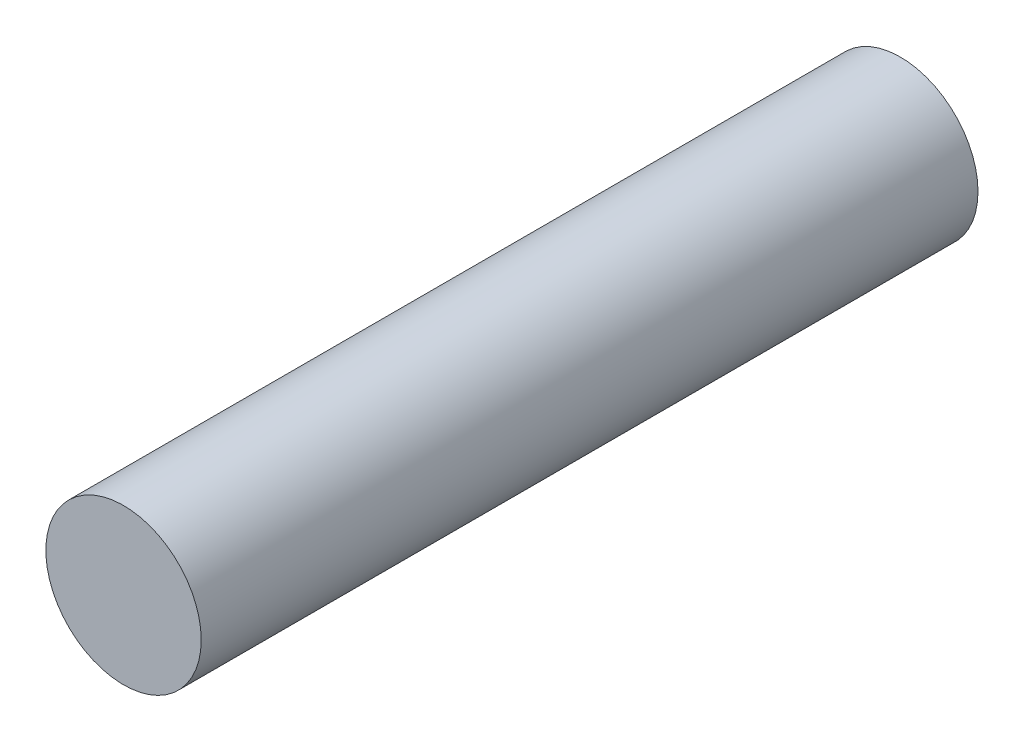
ISO-10303-21;
HEADER;
FILE_DESCRIPTION(('STEP AP214'),'2;1');
FILE_NAME('part.step','',(''),(''),'','','');
FILE_SCHEMA(('AUTOMOTIVE_DESIGN { 1 0 10303 214 1 1 1 1 }'));
ENDSEC;
DATA;
#1=APPLICATION_CONTEXT('core data for automotive mechanical design processes');
#2=APPLICATION_PROTOCOL_DEFINITION('international standard','automotive_design',2000,#1);
#3=PRODUCT_CONTEXT('',#1,'mechanical');
#4=PRODUCT('Part','Part','',(#3));
#5=PRODUCT_RELATED_PRODUCT_CATEGORY('part','',(#4));
#6=PRODUCT_DEFINITION_FORMATION('','',#4);
#7=PRODUCT_DEFINITION_CONTEXT('part definition',#1,'design');
#8=PRODUCT_DEFINITION('design','',#6,#7);
#9=PRODUCT_DEFINITION_SHAPE('','',#8);
#10=(LENGTH_UNIT() NAMED_UNIT(*) SI_UNIT(.MILLI.,.METRE.));
#11=(NAMED_UNIT(*) PLANE_ANGLE_UNIT() SI_UNIT($,.RADIAN.));
#12=(NAMED_UNIT(*) SI_UNIT($,.STERADIAN.) SOLID_ANGLE_UNIT());
#13=UNCERTAINTY_MEASURE_WITH_UNIT(LENGTH_MEASURE(1.E-05),#10,'distance_accuracy_value','');
#14=(GEOMETRIC_REPRESENTATION_CONTEXT(3) GLOBAL_UNCERTAINTY_ASSIGNED_CONTEXT((#13)) GLOBAL_UNIT_ASSIGNED_CONTEXT((#10,
#11,#12)) REPRESENTATION_CONTEXT('',''));
#15=CARTESIAN_POINT('',(0.,0.,0.));
#16=DIRECTION('',(0.,0.,1.));
#17=DIRECTION('',(1.,0.,0.));
#18=AXIS2_PLACEMENT_3D('',#15,#16,#17);
#19=CARTESIAN_POINT('',(0.,0.,10.));
#20=DIRECTION('',(0.,0.,-1.));
#21=DIRECTION('',(-1.,0.,0.));
#22=AXIS2_PLACEMENT_3D('',#19,#20,#21);
#23=CYLINDRICAL_SURFACE('',#22,1.);
#24=CARTESIAN_POINT('',(0.,0.,10.));
#25=DIRECTION('',(0.,0.,1.));
#26=DIRECTION('',(1.,0.,0.));
#27=AXIS2_PLACEMENT_3D('',#24,#25,#26);
#28=CIRCLE('',#27,1.);
#29=CARTESIAN_POINT('',(1.,0.,10.));
#30=VERTEX_POINT('',#29);
#31=EDGE_CURVE('E10',#30,#30,#28,.T.);
#32=ORIENTED_EDGE('',*,*,#31,.F.);
#33=EDGE_LOOP('',(#32));
#34=FACE_BOUND('',#33,.T.);
#35=CARTESIAN_POINT('',(0.,0.,0.));
#36=DIRECTION('',(0.,0.,1.));
#37=DIRECTION('',(1.,0.,0.));
#38=AXIS2_PLACEMENT_3D('',#35,#36,#37);
#39=CIRCLE('',#38,1.);
#40=CARTESIAN_POINT('',(1.,0.,0.));
#41=VERTEX_POINT('',#40);
#42=EDGE_CURVE('E38',#41,#41,#39,.T.);
#43=ORIENTED_EDGE('',*,*,#42,.T.);
#44=EDGE_LOOP('',(#43));
#45=FACE_BOUND('',#44,.T.);
#46=ADVANCED_FACE('F35',(#34,#45),#23,.T.);
#47=CARTESIAN_POINT('',(0.,0.,10.));
#48=DIRECTION('',(0.,0.,1.));
#49=DIRECTION('',(1.,0.,0.));
#50=AXIS2_PLACEMENT_3D('',#47,#48,#49);
#51=PLANE('',#50);
#52=ORIENTED_EDGE('',*,*,#31,.T.);
#53=EDGE_LOOP('',(#52));
#54=FACE_BOUND('',#53,.T.);
#55=ADVANCED_FACE('F50',(#54),#51,.T.);
#56=CARTESIAN_POINT('',(0.,0.,0.));
#57=DIRECTION('',(0.,0.,1.));
#58=DIRECTION('',(1.,0.,0.));
#59=AXIS2_PLACEMENT_3D('',#56,#57,#58);
#60=PLANE('',#59);
#61=ORIENTED_EDGE('',*,*,#42,.F.);
#62=EDGE_LOOP('',(#61));
#63=FACE_BOUND('',#62,.T.);
#64=ADVANCED_FACE('F48',(#63),#60,.F.);
#65=CLOSED_SHELL('',(#46,#55,#64));
#66=MANIFOLD_SOLID_BREP('B2',#65);
#67=ADVANCED_BREP_SHAPE_REPRESENTATION('',(#18,#66),#14);
#68=SHAPE_DEFINITION_REPRESENTATION(#9,#67);
ENDSEC;
END-ISO-10303-21;
